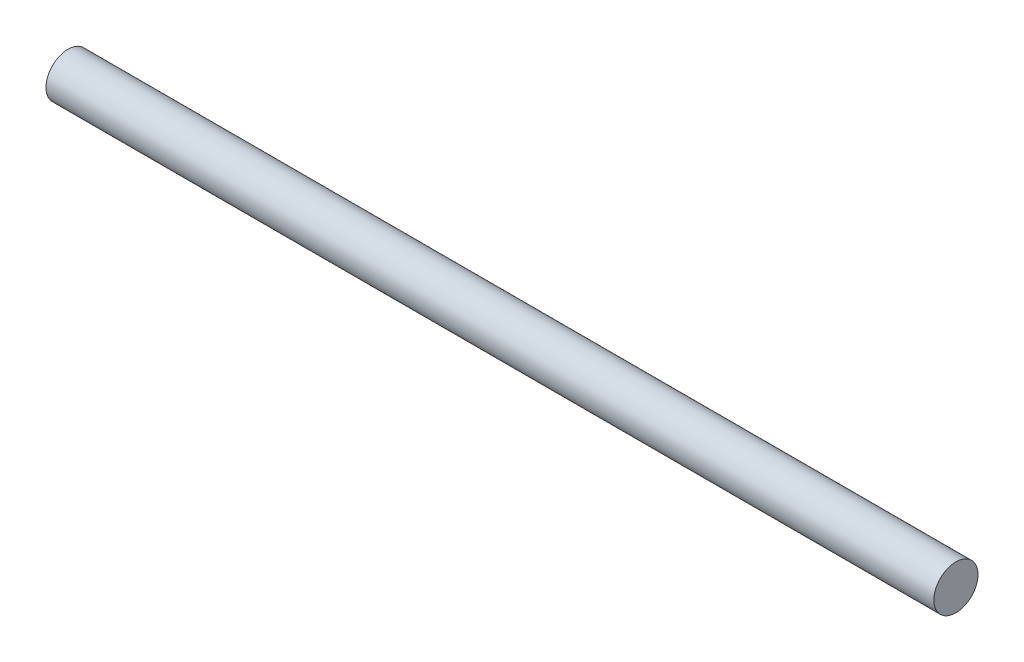
ISO-10303-21;
HEADER;
FILE_DESCRIPTION(('STEP AP214'),'2;1');
FILE_NAME('part.step','',(''),(''),'','','');
FILE_SCHEMA(('AUTOMOTIVE_DESIGN { 1 0 10303 214 1 1 1 1 }'));
ENDSEC;
DATA;
#1=APPLICATION_CONTEXT('core data for automotive mechanical design processes');
#2=APPLICATION_PROTOCOL_DEFINITION('international standard','automotive_design',2000,#1);
#3=PRODUCT_CONTEXT('',#1,'mechanical');
#4=PRODUCT('Part','Part','',(#3));
#5=PRODUCT_RELATED_PRODUCT_CATEGORY('part','',(#4));
#6=PRODUCT_DEFINITION_FORMATION('','',#4);
#7=PRODUCT_DEFINITION_CONTEXT('part definition',#1,'design');
#8=PRODUCT_DEFINITION('design','',#6,#7);
#9=PRODUCT_DEFINITION_SHAPE('','',#8);
#10=(LENGTH_UNIT() NAMED_UNIT(*) SI_UNIT(.MILLI.,.METRE.));
#11=(NAMED_UNIT(*) PLANE_ANGLE_UNIT() SI_UNIT($,.RADIAN.));
#12=(NAMED_UNIT(*) SI_UNIT($,.STERADIAN.) SOLID_ANGLE_UNIT());
#13=UNCERTAINTY_MEASURE_WITH_UNIT(LENGTH_MEASURE(1.E-05),#10,'distance_accuracy_value','');
#14=(GEOMETRIC_REPRESENTATION_CONTEXT(3) GLOBAL_UNCERTAINTY_ASSIGNED_CONTEXT((#13)) GLOBAL_UNIT_ASSIGNED_CONTEXT((#10,
#11,#12)) REPRESENTATION_CONTEXT('',''));
#15=CARTESIAN_POINT('',(0.,0.,0.));
#16=DIRECTION('',(0.,0.,1.));
#17=DIRECTION('',(1.,0.,0.));
#18=AXIS2_PLACEMENT_3D('',#15,#16,#17);
#19=CARTESIAN_POINT('',(30.15,0.,0.));
#20=DIRECTION('',(-1.,0.,0.));
#21=DIRECTION('',(0.,0.,1.));
#22=AXIS2_PLACEMENT_3D('',#19,#20,#21);
#23=CYLINDRICAL_SURFACE('',#22,1.5);
#24=CARTESIAN_POINT('',(30.15,0.,0.));
#25=DIRECTION('',(1.,0.,0.));
#26=DIRECTION('',(0.,0.,-1.));
#27=AXIS2_PLACEMENT_3D('',#24,#25,#26);
#28=CIRCLE('',#27,1.5);
#29=CARTESIAN_POINT('',(30.15,0.,-1.5));
#30=VERTEX_POINT('',#29);
#31=EDGE_CURVE('E10',#30,#30,#28,.T.);
#32=ORIENTED_EDGE('',*,*,#31,.F.);
#33=EDGE_LOOP('',(#32));
#34=FACE_BOUND('',#33,.T.);
#35=CARTESIAN_POINT('',(-30.15,0.,0.));
#36=DIRECTION('',(1.,0.,0.));
#37=DIRECTION('',(0.,0.,-1.));
#38=AXIS2_PLACEMENT_3D('',#35,#36,#37);
#39=CIRCLE('',#38,1.5);
#40=CARTESIAN_POINT('',(-30.15,0.,-1.5));
#41=VERTEX_POINT('',#40);
#42=EDGE_CURVE('E35',#41,#41,#39,.T.);
#43=ORIENTED_EDGE('',*,*,#42,.T.);
#44=EDGE_LOOP('',(#43));
#45=FACE_BOUND('',#44,.T.);
#46=ADVANCED_FACE('F32',(#34,#45),#23,.T.);
#47=CARTESIAN_POINT('',(30.15,0.,0.));
#48=DIRECTION('',(1.,0.,0.));
#49=DIRECTION('',(0.,0.,-1.));
#50=AXIS2_PLACEMENT_3D('',#47,#48,#49);
#51=PLANE('',#50);
#52=ORIENTED_EDGE('',*,*,#31,.T.);
#53=EDGE_LOOP('',(#52));
#54=FACE_BOUND('',#53,.T.);
#55=ADVANCED_FACE('F47',(#54),#51,.T.);
#56=CARTESIAN_POINT('',(-30.15,0.,0.));
#57=DIRECTION('',(1.,0.,0.));
#58=DIRECTION('',(0.,0.,-1.));
#59=AXIS2_PLACEMENT_3D('',#56,#57,#58);
#60=PLANE('',#59);
#61=ORIENTED_EDGE('',*,*,#42,.F.);
#62=EDGE_LOOP('',(#61));
#63=FACE_BOUND('',#62,.T.);
#64=ADVANCED_FACE('F45',(#63),#60,.F.);
#65=CLOSED_SHELL('',(#46,#55,#64));
#66=MANIFOLD_SOLID_BREP('B2',#65);
#67=ADVANCED_BREP_SHAPE_REPRESENTATION('',(#18,#66),#14);
#68=SHAPE_DEFINITION_REPRESENTATION(#9,#67);
ENDSEC;
END-ISO-10303-21;
